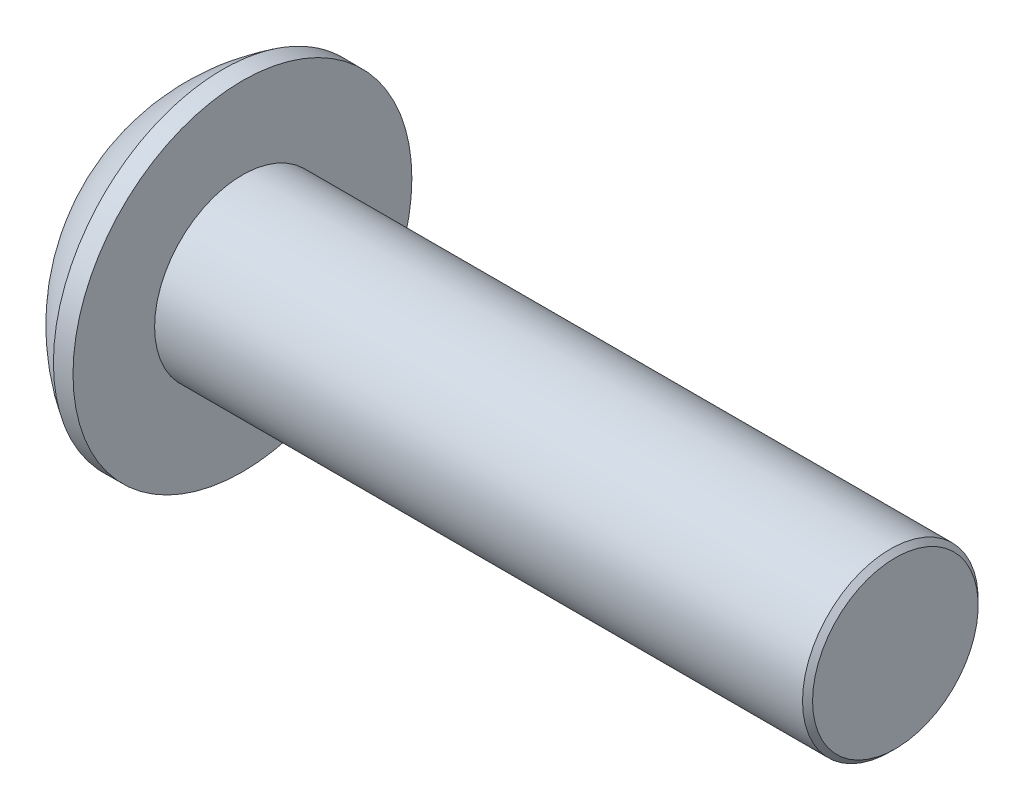
ISO-10303-21;
HEADER;
FILE_DESCRIPTION(('STEP AP214'),'2;1');
FILE_NAME('part.step','',(''),(''),'','','');
FILE_SCHEMA(('AUTOMOTIVE_DESIGN { 1 0 10303 214 1 1 1 1 }'));
ENDSEC;
DATA;
#1=APPLICATION_CONTEXT('core data for automotive mechanical design processes');
#2=APPLICATION_PROTOCOL_DEFINITION('international standard','automotive_design',2000,#1);
#3=PRODUCT_CONTEXT('',#1,'mechanical');
#4=PRODUCT('Part','Part','',(#3));
#5=PRODUCT_RELATED_PRODUCT_CATEGORY('part','',(#4));
#6=PRODUCT_DEFINITION_FORMATION('','',#4);
#7=PRODUCT_DEFINITION_CONTEXT('part definition',#1,'design');
#8=PRODUCT_DEFINITION('design','',#6,#7);
#9=PRODUCT_DEFINITION_SHAPE('','',#8);
#10=(LENGTH_UNIT() NAMED_UNIT(*) SI_UNIT(.MILLI.,.METRE.));
#11=(NAMED_UNIT(*) PLANE_ANGLE_UNIT() SI_UNIT($,.RADIAN.));
#12=(NAMED_UNIT(*) SI_UNIT($,.STERADIAN.) SOLID_ANGLE_UNIT());
#13=UNCERTAINTY_MEASURE_WITH_UNIT(LENGTH_MEASURE(1.E-05),#10,'distance_accuracy_value','');
#14=(GEOMETRIC_REPRESENTATION_CONTEXT(3) GLOBAL_UNCERTAINTY_ASSIGNED_CONTEXT((#13)) GLOBAL_UNIT_ASSIGNED_CONTEXT((#10,
#11,#12)) REPRESENTATION_CONTEXT('',''));
#15=CARTESIAN_POINT('',(0.,0.,0.));
#16=DIRECTION('',(0.,0.,1.));
#17=DIRECTION('',(1.,0.,0.));
#18=AXIS2_PLACEMENT_3D('',#15,#16,#17);
#19=CARTESIAN_POINT('',(1.32080000000034,0.,0.));
#20=DIRECTION('',(-1.,0.,0.));
#21=DIRECTION('',(0.,0.,1.));
#22=AXIS2_PLACEMENT_3D('',#19,#20,#21);
#23=CONICAL_SURFACE('',#22,1.1937999999998,1.04719755119608);
#24=CARTESIAN_POINT('',(2.01004075135902,0.,4.44089209850063E-13));
#25=VERTEX_POINT('',#24);
#26=VERTEX_LOOP('',#25);
#27=FACE_BOUND('',#26,.T.);
#28=CARTESIAN_POINT('',(1.32080000000009,0.,0.));
#29=DIRECTION('',(-1.,0.,0.));
#30=DIRECTION('',(0.,0.,1.));
#31=AXIS2_PLACEMENT_3D('',#28,#29,#30);
#32=CIRCLE('',#31,1.19380000000024);
#33=CARTESIAN_POINT('',(1.32080000000004,-1.03386112703797,0.59690000000006));
#34=VERTEX_POINT('',#33);
#35=CARTESIAN_POINT('',(1.32080000000004,0.,1.19380000000012));
#36=VERTEX_POINT('',#35);
#37=EDGE_CURVE('E18',#34,#36,#32,.T.);
#38=ORIENTED_EDGE('',*,*,#37,.T.);
#39=CARTESIAN_POINT('',(1.32080000000009,0.,0.));
#40=DIRECTION('',(-1.,0.,0.));
#41=DIRECTION('',(0.,0.,1.));
#42=AXIS2_PLACEMENT_3D('',#39,#40,#41);
#43=CIRCLE('',#42,1.19380000000024);
#44=CARTESIAN_POINT('',(1.32080000000004,1.03386112703797,0.596900000000061));
#45=VERTEX_POINT('',#44);
#46=EDGE_CURVE('E146',#36,#45,#43,.T.);
#47=ORIENTED_EDGE('',*,*,#46,.T.);
#48=CARTESIAN_POINT('',(1.32080000000009,0.,0.));
#49=DIRECTION('',(-1.,0.,0.));
#50=DIRECTION('',(0.,0.,1.));
#51=AXIS2_PLACEMENT_3D('',#48,#49,#50);
#52=CIRCLE('',#51,1.19380000000024);
#53=CARTESIAN_POINT('',(1.32080000000004,1.03386112703797,-0.596900000000061));
#54=VERTEX_POINT('',#53);
#55=EDGE_CURVE('E316',#45,#54,#52,.T.);
#56=ORIENTED_EDGE('',*,*,#55,.T.);
#57=CARTESIAN_POINT('',(1.32080000000009,0.,0.));
#58=DIRECTION('',(-1.,0.,0.));
#59=DIRECTION('',(0.,0.,1.));
#60=AXIS2_PLACEMENT_3D('',#57,#58,#59);
#61=CIRCLE('',#60,1.19380000000024);
#62=CARTESIAN_POINT('',(1.32080000000004,1.49457637585666E-12,-1.19380000000012));
#63=VERTEX_POINT('',#62);
#64=EDGE_CURVE('E317',#54,#63,#61,.T.);
#65=ORIENTED_EDGE('',*,*,#64,.T.);
#66=CARTESIAN_POINT('',(1.32080000000009,0.,0.));
#67=DIRECTION('',(-1.,0.,0.));
#68=DIRECTION('',(0.,0.,1.));
#69=AXIS2_PLACEMENT_3D('',#66,#67,#68);
#70=CIRCLE('',#69,1.19380000000024);
#71=CARTESIAN_POINT('',(1.32080000000004,-1.03386112703797,-0.59690000000006));
#72=VERTEX_POINT('',#71);
#73=EDGE_CURVE('E91',#63,#72,#70,.T.);
#74=ORIENTED_EDGE('',*,*,#73,.T.);
#75=CARTESIAN_POINT('',(1.32080000000009,0.,0.));
#76=DIRECTION('',(-1.,0.,0.));
#77=DIRECTION('',(0.,0.,1.));
#78=AXIS2_PLACEMENT_3D('',#75,#76,#77);
#79=CIRCLE('',#78,1.19380000000024);
#80=EDGE_CURVE('E87',#72,#34,#79,.T.);
#81=ORIENTED_EDGE('',*,*,#80,.T.);
#82=EDGE_LOOP('',(#38,#47,#56,#65,#74,#81));
#83=FACE_BOUND('',#82,.T.);
#84=ADVANCED_FACE('F15',(#27,#83),#23,.F.);
#85=CARTESIAN_POINT('',(1.3208,-2.06772225407572,-1.1938));
#86=DIRECTION('',(1.,0.,0.));
#87=DIRECTION('',(0.,0.,-1.));
#88=AXIS2_PLACEMENT_3D('',#85,#86,#87);
#89=PLANE('',#88);
#90=DIRECTION('',(0.,0.5,0.866025403784439));
#91=VECTOR('',#90,1.);
#92=CARTESIAN_POINT('',(1.3208,-1.37848150271715,0.));
#93=LINE('',#92,#91);
#94=CARTESIAN_POINT('',(1.3208,-0.689240751358574,1.1938));
#95=VERTEX_POINT('',#94);
#96=EDGE_CURVE('E99',#95,#34,#93,.F.);
#97=ORIENTED_EDGE('',*,*,#96,.F.);
#98=DIRECTION('',(0.,1.,0.));
#99=VECTOR('',#98,1.);
#100=CARTESIAN_POINT('',(1.3208,-0.689240751358574,1.1938));
#101=LINE('',#100,#99);
#102=EDGE_CURVE('E101',#36,#95,#101,.F.);
#103=ORIENTED_EDGE('',*,*,#102,.F.);
#104=ORIENTED_EDGE('',*,*,#37,.F.);
#105=EDGE_LOOP('',(#97,#103,#104));
#106=FACE_BOUND('',#105,.T.);
#107=ADVANCED_FACE('F97',(#106),#89,.F.);
#108=CARTESIAN_POINT('',(1.3208,-2.06772225407572,-1.1938));
#109=DIRECTION('',(1.,0.,0.));
#110=DIRECTION('',(0.,0.,-1.));
#111=AXIS2_PLACEMENT_3D('',#108,#109,#110);
#112=PLANE('',#111);
#113=DIRECTION('',(0.,-0.5,0.866025403784439));
#114=VECTOR('',#113,1.);
#115=CARTESIAN_POINT('',(1.3208,-0.689240751358574,-1.1938));
#116=LINE('',#115,#114);
#117=CARTESIAN_POINT('',(1.3208,-1.37848150271715,0.));
#118=VERTEX_POINT('',#117);
#119=EDGE_CURVE('E107',#118,#72,#116,.F.);
#120=ORIENTED_EDGE('',*,*,#119,.F.);
#121=DIRECTION('',(0.,0.5,0.866025403784439));
#122=VECTOR('',#121,1.);
#123=CARTESIAN_POINT('',(1.3208,-1.37848150271715,0.));
#124=LINE('',#123,#122);
#125=EDGE_CURVE('E104',#34,#118,#124,.F.);
#126=ORIENTED_EDGE('',*,*,#125,.F.);
#127=ORIENTED_EDGE('',*,*,#80,.F.);
#128=EDGE_LOOP('',(#120,#126,#127));
#129=FACE_BOUND('',#128,.T.);
#130=ADVANCED_FACE('F105',(#129),#112,.F.);
#131=CARTESIAN_POINT('',(1.3208,-2.06772225407572,-1.1938));
#132=DIRECTION('',(1.,0.,0.));
#133=DIRECTION('',(0.,0.,-1.));
#134=AXIS2_PLACEMENT_3D('',#131,#132,#133);
#135=PLANE('',#134);
#136=DIRECTION('',(0.,1.,0.));
#137=VECTOR('',#136,1.);
#138=CARTESIAN_POINT('',(1.3208,0.689240751358577,-1.1938));
#139=LINE('',#138,#137);
#140=CARTESIAN_POINT('',(1.3208,-0.689240751358574,-1.1938));
#141=VERTEX_POINT('',#140);
#142=EDGE_CURVE('E286',#141,#63,#139,.T.);
#143=ORIENTED_EDGE('',*,*,#142,.F.);
#144=DIRECTION('',(0.,-0.5,0.866025403784439));
#145=VECTOR('',#144,1.);
#146=CARTESIAN_POINT('',(1.3208,-0.689240751358574,-1.1938));
#147=LINE('',#146,#145);
#148=EDGE_CURVE('E298',#72,#141,#147,.F.);
#149=ORIENTED_EDGE('',*,*,#148,.F.);
#150=ORIENTED_EDGE('',*,*,#73,.F.);
#151=EDGE_LOOP('',(#143,#149,#150));
#152=FACE_BOUND('',#151,.T.);
#153=ADVANCED_FACE('F189',(#152),#135,.F.);
#154=CARTESIAN_POINT('',(1.3208,-2.06772225407572,-1.1938));
#155=DIRECTION('',(1.,0.,0.));
#156=DIRECTION('',(0.,0.,-1.));
#157=AXIS2_PLACEMENT_3D('',#154,#155,#156);
#158=PLANE('',#157);
#159=DIRECTION('',(0.,-0.5,-0.866025403784439));
#160=VECTOR('',#159,1.);
#161=CARTESIAN_POINT('',(1.3208,1.37848150271715,0.));
#162=LINE('',#161,#160);
#163=CARTESIAN_POINT('',(1.3208,0.689240751358577,-1.1938));
#164=VERTEX_POINT('',#163);
#165=EDGE_CURVE('E272',#164,#54,#162,.F.);
#166=ORIENTED_EDGE('',*,*,#165,.F.);
#167=DIRECTION('',(0.,1.,0.));
#168=VECTOR('',#167,1.);
#169=CARTESIAN_POINT('',(1.3208,0.689240751358577,-1.1938));
#170=LINE('',#169,#168);
#171=EDGE_CURVE('E283',#63,#164,#170,.T.);
#172=ORIENTED_EDGE('',*,*,#171,.F.);
#173=ORIENTED_EDGE('',*,*,#64,.F.);
#174=EDGE_LOOP('',(#166,#172,#173));
#175=FACE_BOUND('',#174,.T.);
#176=ADVANCED_FACE('F185',(#175),#158,.F.);
#177=CARTESIAN_POINT('',(1.3208,-2.06772225407572,-1.1938));
#178=DIRECTION('',(1.,0.,0.));
#179=DIRECTION('',(0.,0.,-1.));
#180=AXIS2_PLACEMENT_3D('',#177,#178,#179);
#181=PLANE('',#180);
#182=DIRECTION('',(0.,0.5,-0.866025403784439));
#183=VECTOR('',#182,1.);
#184=CARTESIAN_POINT('',(1.3208,0.689240751358576,1.1938));
#185=LINE('',#184,#183);
#186=CARTESIAN_POINT('',(1.3208,1.37848150271715,0.));
#187=VERTEX_POINT('',#186);
#188=EDGE_CURVE('E251',#187,#45,#185,.F.);
#189=ORIENTED_EDGE('',*,*,#188,.F.);
#190=DIRECTION('',(0.,-0.5,-0.866025403784439));
#191=VECTOR('',#190,1.);
#192=CARTESIAN_POINT('',(1.3208,1.37848150271715,0.));
#193=LINE('',#192,#191);
#194=EDGE_CURVE('E270',#54,#187,#193,.F.);
#195=ORIENTED_EDGE('',*,*,#194,.F.);
#196=ORIENTED_EDGE('',*,*,#55,.F.);
#197=EDGE_LOOP('',(#189,#195,#196));
#198=FACE_BOUND('',#197,.T.);
#199=ADVANCED_FACE('F181',(#198),#181,.F.);
#200=CARTESIAN_POINT('',(1.3208,-2.06772225407572,-1.1938));
#201=DIRECTION('',(1.,0.,0.));
#202=DIRECTION('',(0.,0.,-1.));
#203=AXIS2_PLACEMENT_3D('',#200,#201,#202);
#204=PLANE('',#203);
#205=DIRECTION('',(0.,1.,0.));
#206=VECTOR('',#205,1.);
#207=CARTESIAN_POINT('',(1.3208,-0.689240751358574,1.1938));
#208=LINE('',#207,#206);
#209=CARTESIAN_POINT('',(1.3208,0.689240751358576,1.1938));
#210=VERTEX_POINT('',#209);
#211=EDGE_CURVE('E116',#210,#36,#208,.F.);
#212=ORIENTED_EDGE('',*,*,#211,.F.);
#213=DIRECTION('',(0.,0.5,-0.866025403784439));
#214=VECTOR('',#213,1.);
#215=CARTESIAN_POINT('',(1.3208,0.689240751358576,1.1938));
#216=LINE('',#215,#214);
#217=EDGE_CURVE('E254',#45,#210,#216,.F.);
#218=ORIENTED_EDGE('',*,*,#217,.F.);
#219=ORIENTED_EDGE('',*,*,#46,.F.);
#220=EDGE_LOOP('',(#212,#218,#219));
#221=FACE_BOUND('',#220,.T.);
#222=ADVANCED_FACE('F177',(#221),#204,.F.);
#223=CARTESIAN_POINT('',(1.3208,-0.689240751358574,1.1938));
#224=DIRECTION('',(0.,0.,-1.));
#225=DIRECTION('',(0.,1.,0.));
#226=AXIS2_PLACEMENT_3D('',#223,#224,#225);
#227=PLANE('',#226);
#228=DIRECTION('',(0.,1.,0.));
#229=VECTOR('',#228,1.);
#230=CARTESIAN_POINT('',(0.,0.,1.1938));
#231=LINE('',#230,#229);
#232=CARTESIAN_POINT('',(0.,0.689240751358577,1.1938));
#233=VERTEX_POINT('',#232);
#234=CARTESIAN_POINT('',(0.,-0.689240751358574,1.1938));
#235=VERTEX_POINT('',#234);
#236=EDGE_CURVE('E248',#233,#235,#231,.F.);
#237=ORIENTED_EDGE('',*,*,#236,.F.);
#238=DIRECTION('',(1.,0.,0.));
#239=VECTOR('',#238,1.);
#240=CARTESIAN_POINT('',(1.3208,0.689240751358576,1.1938));
#241=LINE('',#240,#239);
#242=EDGE_CURVE('E260',#210,#233,#241,.F.);
#243=ORIENTED_EDGE('',*,*,#242,.F.);
#244=ORIENTED_EDGE('',*,*,#211,.T.);
#245=ORIENTED_EDGE('',*,*,#102,.T.);
#246=DIRECTION('',(1.,0.,0.));
#247=VECTOR('',#246,1.);
#248=CARTESIAN_POINT('',(1.3208,-0.689240751358574,1.1938));
#249=LINE('',#248,#247);
#250=EDGE_CURVE('E110',#235,#95,#249,.T.);
#251=ORIENTED_EDGE('',*,*,#250,.F.);
#252=EDGE_LOOP('',(#237,#243,#244,#245,#251));
#253=FACE_BOUND('',#252,.T.);
#254=ADVANCED_FACE('F174',(#253),#227,.T.);
#255=CARTESIAN_POINT('',(1.3208,-1.37848150271715,0.));
#256=DIRECTION('',(0.,0.866025403784439,-0.5));
#257=DIRECTION('',(0.,0.5,0.866025403784439));
#258=AXIS2_PLACEMENT_3D('',#255,#256,#257);
#259=PLANE('',#258);
#260=DIRECTION('',(0.,-0.5,-0.866025403784439));
#261=VECTOR('',#260,1.);
#262=CARTESIAN_POINT('',(0.,-0.689240751358574,1.1938));
#263=LINE('',#262,#261);
#264=CARTESIAN_POINT('',(0.,-1.37848150271715,0.));
#265=VERTEX_POINT('',#264);
#266=EDGE_CURVE('E245',#235,#265,#263,.T.);
#267=ORIENTED_EDGE('',*,*,#266,.F.);
#268=ORIENTED_EDGE('',*,*,#250,.T.);
#269=ORIENTED_EDGE('',*,*,#96,.T.);
#270=ORIENTED_EDGE('',*,*,#125,.T.);
#271=DIRECTION('',(1.,0.,0.));
#272=VECTOR('',#271,1.);
#273=CARTESIAN_POINT('',(1.3208,-1.37848150271715,0.));
#274=LINE('',#273,#272);
#275=EDGE_CURVE('E295',#265,#118,#274,.T.);
#276=ORIENTED_EDGE('',*,*,#275,.F.);
#277=EDGE_LOOP('',(#267,#268,#269,#270,#276));
#278=FACE_BOUND('',#277,.T.);
#279=ADVANCED_FACE('F114',(#278),#259,.T.);
#280=CARTESIAN_POINT('',(1.3208,-0.689240751358574,-1.1938));
#281=DIRECTION('',(0.,0.866025403784439,0.5));
#282=DIRECTION('',(0.,-0.5,0.866025403784439));
#283=AXIS2_PLACEMENT_3D('',#280,#281,#282);
#284=PLANE('',#283);
#285=DIRECTION('',(0.,0.5,-0.866025403784439));
#286=VECTOR('',#285,1.);
#287=CARTESIAN_POINT('',(0.,-1.37848150271715,0.));
#288=LINE('',#287,#286);
#289=CARTESIAN_POINT('',(0.,-0.689240751358574,-1.1938));
#290=VERTEX_POINT('',#289);
#291=EDGE_CURVE('E242',#265,#290,#288,.T.);
#292=ORIENTED_EDGE('',*,*,#291,.F.);
#293=ORIENTED_EDGE('',*,*,#275,.T.);
#294=ORIENTED_EDGE('',*,*,#119,.T.);
#295=ORIENTED_EDGE('',*,*,#148,.T.);
#296=DIRECTION('',(1.,0.,0.));
#297=VECTOR('',#296,1.);
#298=CARTESIAN_POINT('',(1.3208,-0.689240751358574,-1.1938));
#299=LINE('',#298,#297);
#300=EDGE_CURVE('E280',#290,#141,#299,.T.);
#301=ORIENTED_EDGE('',*,*,#300,.F.);
#302=EDGE_LOOP('',(#292,#293,#294,#295,#301));
#303=FACE_BOUND('',#302,.T.);
#304=ADVANCED_FACE('F167',(#303),#284,.T.);
#305=CARTESIAN_POINT('',(1.3208,0.689240751358577,-1.1938));
#306=DIRECTION('',(0.,0.,1.));
#307=DIRECTION('',(1.,0.,0.));
#308=AXIS2_PLACEMENT_3D('',#305,#306,#307);
#309=PLANE('',#308);
#310=DIRECTION('',(0.,1.,0.));
#311=VECTOR('',#310,1.);
#312=CARTESIAN_POINT('',(0.,0.,-1.1938));
#313=LINE('',#312,#311);
#314=CARTESIAN_POINT('',(0.,0.689240751358577,-1.1938));
#315=VERTEX_POINT('',#314);
#316=EDGE_CURVE('E239',#290,#315,#313,.T.);
#317=ORIENTED_EDGE('',*,*,#316,.F.);
#318=ORIENTED_EDGE('',*,*,#300,.T.);
#319=ORIENTED_EDGE('',*,*,#142,.T.);
#320=ORIENTED_EDGE('',*,*,#171,.T.);
#321=DIRECTION('',(1.,0.,0.));
#322=VECTOR('',#321,1.);
#323=CARTESIAN_POINT('',(1.3208,0.689240751358577,-1.1938));
#324=LINE('',#323,#322);
#325=EDGE_CURVE('E255',#315,#164,#324,.T.);
#326=ORIENTED_EDGE('',*,*,#325,.F.);
#327=EDGE_LOOP('',(#317,#318,#319,#320,#326));
#328=FACE_BOUND('',#327,.T.);
#329=ADVANCED_FACE('F164',(#328),#309,.T.);
#330=CARTESIAN_POINT('',(1.3208,1.37848150271715,0.));
#331=DIRECTION('',(0.,-0.866025403784439,0.5));
#332=DIRECTION('',(0.,-0.5,-0.866025403784439));
#333=AXIS2_PLACEMENT_3D('',#330,#331,#332);
#334=PLANE('',#333);
#335=DIRECTION('',(0.,0.5,0.866025403784439));
#336=VECTOR('',#335,1.);
#337=CARTESIAN_POINT('',(0.,0.689240751358577,-1.1938));
#338=LINE('',#337,#336);
#339=CARTESIAN_POINT('',(0.,1.37848150271715,0.));
#340=VERTEX_POINT('',#339);
#341=EDGE_CURVE('E236',#315,#340,#338,.T.);
#342=ORIENTED_EDGE('',*,*,#341,.F.);
#343=ORIENTED_EDGE('',*,*,#325,.T.);
#344=ORIENTED_EDGE('',*,*,#165,.T.);
#345=ORIENTED_EDGE('',*,*,#194,.T.);
#346=DIRECTION('',(1.,0.,0.));
#347=VECTOR('',#346,1.);
#348=CARTESIAN_POINT('',(1.3208,1.37848150271715,0.));
#349=LINE('',#348,#347);
#350=EDGE_CURVE('E33',#340,#187,#349,.T.);
#351=ORIENTED_EDGE('',*,*,#350,.F.);
#352=EDGE_LOOP('',(#342,#343,#344,#345,#351));
#353=FACE_BOUND('',#352,.T.);
#354=ADVANCED_FACE('F160',(#353),#334,.T.);
#355=CARTESIAN_POINT('',(1.3208,0.689240751358576,1.1938));
#356=DIRECTION('',(0.,-0.866025403784439,-0.5));
#357=DIRECTION('',(0.,0.5,-0.866025403784439));
#358=AXIS2_PLACEMENT_3D('',#355,#356,#357);
#359=PLANE('',#358);
#360=DIRECTION('',(0.,-0.5,0.866025403784439));
#361=VECTOR('',#360,1.);
#362=CARTESIAN_POINT('',(0.,1.37848150271715,0.));
#363=LINE('',#362,#361);
#364=EDGE_CURVE('E145',#340,#233,#363,.T.);
#365=ORIENTED_EDGE('',*,*,#364,.F.);
#366=ORIENTED_EDGE('',*,*,#350,.T.);
#367=ORIENTED_EDGE('',*,*,#188,.T.);
#368=ORIENTED_EDGE('',*,*,#217,.T.);
#369=ORIENTED_EDGE('',*,*,#242,.T.);
#370=EDGE_LOOP('',(#365,#366,#367,#368,#369));
#371=FACE_BOUND('',#370,.T.);
#372=ADVANCED_FACE('F156',(#371),#359,.T.);
#373=CARTESIAN_POINT('',(0.,0.,0.));
#374=DIRECTION('',(-1.,0.,0.));
#375=DIRECTION('',(0.,0.,1.));
#376=AXIS2_PLACEMENT_3D('',#373,#374,#375);
#377=PLANE('',#376);
#378=ORIENTED_EDGE('',*,*,#341,.T.);
#379=ORIENTED_EDGE('',*,*,#364,.T.);
#380=ORIENTED_EDGE('',*,*,#236,.T.);
#381=ORIENTED_EDGE('',*,*,#266,.T.);
#382=ORIENTED_EDGE('',*,*,#291,.T.);
#383=ORIENTED_EDGE('',*,*,#316,.T.);
#384=EDGE_LOOP('',(#378,#379,#380,#381,#382,#383));
#385=FACE_BOUND('',#384,.T.);
#386=CARTESIAN_POINT('',(0.,1.647825,0.));
#387=CARTESIAN_POINT('',(1.63319194702151E-13,1.64781976319874,0.092490203977753));
#388=CARTESIAN_POINT('',(1.32890083579297E-13,1.63999511633709,0.18514501432637));
#389=CARTESIAN_POINT('',(0.,1.6167119250047,0.322075808080013));
#390=CARTESIAN_POINT('',(-1.58500729597375E-13,1.60700618770234,0.36743553339636));
#391=CARTESIAN_POINT('',(1.59063479291743E-13,1.58380101865853,0.45722093569514));
#392=CARTESIAN_POINT('',(5.6924253476393E-13,1.5702985083103,0.501645823115263));
#393=CARTESIAN_POINT('',(9.37393023603841E-13,1.52428156574313,0.632817459278967));
#394=CARTESIAN_POINT('',(0.,1.48621992666366,0.717681965518643));
#395=CARTESIAN_POINT('',(0.,1.39637079695658,0.879809706624016));
#396=CARTESIAN_POINT('',(7.82184274151218E-13,1.34458278455109,0.957072652379995));
#397=CARTESIAN_POINT('',(4.86982737501784E-13,1.25777784714521,1.06558770210237));
#398=CARTESIAN_POINT('',(1.33453761487452E-13,1.22729946114794,1.10054993332365));
#399=CARTESIAN_POINT('',(-1.3289162015903E-13,1.16354004969106,1.16775237388221));
#400=CARTESIAN_POINT('',(0.,1.13026175473033,1.19999517515816));
#401=CARTESIAN_POINT('',(0.,1.02649304340867,1.29236218866442));
#402=CARTESIAN_POINT('',(0.,0.952049986714077,1.34814848277712));
#403=CARTESIAN_POINT('',(0.,0.794895196754067,1.44639825105765));
#404=CARTESIAN_POINT('',(0.,0.712183775431296,1.48886222758992));
#405=CARTESIAN_POINT('',(0.,0.540796624265731,1.55930919813143));
#406=CARTESIAN_POINT('',(0.,0.452120958135287,1.58729234680268));
#407=CARTESIAN_POINT('',(0.,0.271332331080319,1.62797191307413));
#408=CARTESIAN_POINT('',(0.,0.179219351801791,1.64066824903626));
#409=CARTESIAN_POINT('',(0.,-0.0058307702784061,1.65041748705408));
#410=CARTESIAN_POINT('',(0.,-0.0987679130800752,1.64747038910978));
#411=CARTESIAN_POINT('',(0.,-0.282830196388822,1.62601274134435));
#412=CARTESIAN_POINT('',(0.,-0.373955346570016,1.60750227463794));
#413=CARTESIAN_POINT('',(0.,-0.551796068178801,1.55545413364523));
#414=CARTESIAN_POINT('',(0.,-0.638511592498163,1.52191629885843));
#415=CARTESIAN_POINT('',(0.,-0.805120175533149,1.44072378052346));
#416=CARTESIAN_POINT('',(0.,-0.885012976819951,1.39306856461393));
#417=CARTESIAN_POINT('',(0.,-0.997912879588355,1.31211658756413));
#418=CARTESIAN_POINT('',(0.,-1.0343949246834,1.28354906167734));
#419=CARTESIAN_POINT('',(0.,-1.10486279842068,1.22341829303709));
#420=CARTESIAN_POINT('',(0.,-1.13884618403291,1.19185218578117));
#421=CARTESIAN_POINT('',(0.,-1.23657300939908,1.09305906467359));
#422=CARTESIAN_POINT('',(0.,-1.29619288399356,1.02166556658612));
#423=CARTESIAN_POINT('',(0.,-1.40258050817755,0.869876423478031));
#424=CARTESIAN_POINT('',(0.,-1.44934874627766,0.789481120793477));
#425=CARTESIAN_POINT('',(0.,-1.50889406070375,0.66387095931334));
#426=CARTESIAN_POINT('',(0.,-1.52698985473586,0.621110806760426));
#427=CARTESIAN_POINT('',(0.,-1.55950093966664,0.53426077686433));
#428=CARTESIAN_POINT('',(-1.05235362596779E-13,-1.57391920916438,0.490172008203167));
#429=CARTESIAN_POINT('',(2.10568324685354E-13,-1.61146177909579,0.356445777718595));
#430=CARTESIAN_POINT('',(1.14396658334039E-12,-1.62897899568074,0.265126085962904));
#431=CARTESIAN_POINT('',(4.347347107204E-13,-1.64174347214908,0.144386595969386));
#432=CARTESIAN_POINT('',(1.21682740895759E-13,-1.64402207668915,0.115560405797873));
#433=CARTESIAN_POINT('',(-1.21249060026839E-13,-1.6470636594012,0.0578281757252688));
#434=CARTESIAN_POINT('',(0.,-1.64782663757318,0.0289221358241775));
#435=CARTESIAN_POINT('',(1.63505268006993E-13,-1.64781976319874,-0.0924902039777536));
#436=CARTESIAN_POINT('',(1.32794566155401E-13,-1.63999511633709,-0.18514501432637));
#437=CARTESIAN_POINT('',(0.,-1.6167119250047,-0.322075808080014));
#438=CARTESIAN_POINT('',(-1.58310187784522E-13,-1.60700618770234,-0.367435533396361));
#439=CARTESIAN_POINT('',(1.58872782530651E-13,-1.58380101865853,-0.45722093569514));
#440=CARTESIAN_POINT('',(5.68527399730162E-13,-1.5702985083103,-0.501645823115263));
#441=CARTESIAN_POINT('',(9.36221934104128E-13,-1.52428156574313,-0.632817459278966));
#442=CARTESIAN_POINT('',(0.,-1.48621992666366,-0.717681965518643));
#443=CARTESIAN_POINT('',(0.,-1.39637079695658,-0.879809706624015));
#444=CARTESIAN_POINT('',(7.809853327574E-13,-1.34458278455109,-0.957072652379992));
#445=CARTESIAN_POINT('',(4.86281382838322E-13,-1.25777784714521,-1.06558770210237));
#446=CARTESIAN_POINT('',(1.33300307899813E-13,-1.22729946114794,-1.10054993332365));
#447=CARTESIAN_POINT('',(-1.32738314523763E-13,-1.16354004969107,-1.16775237388221));
#448=CARTESIAN_POINT('',(0.,-1.13026175473033,-1.19999517515816));
#449=CARTESIAN_POINT('',(0.,-1.02649304340867,-1.29236218866442));
#450=CARTESIAN_POINT('',(0.,-0.952049986714081,-1.34814848277713));
#451=CARTESIAN_POINT('',(0.,-0.794895196754072,-1.44639825105765));
#452=CARTESIAN_POINT('',(0.,-0.7121837754313,-1.48886222758991));
#453=CARTESIAN_POINT('',(0.,-0.540796624265734,-1.55930919813143));
#454=CARTESIAN_POINT('',(0.,-0.452120958135291,-1.58729234680268));
#455=CARTESIAN_POINT('',(0.,-0.271332331080322,-1.62797191307413));
#456=CARTESIAN_POINT('',(0.,-0.179219351801793,-1.64066824903626));
#457=CARTESIAN_POINT('',(0.,0.00583077027840386,-1.65041748705408));
#458=CARTESIAN_POINT('',(0.,0.0987679130800731,-1.64747038910978));
#459=CARTESIAN_POINT('',(0.,0.28283019638882,-1.62601274134436));
#460=CARTESIAN_POINT('',(0.,0.373955346570014,-1.60750227463794));
#461=CARTESIAN_POINT('',(0.,0.551796068178799,-1.55545413364523));
#462=CARTESIAN_POINT('',(0.,0.638511592498161,-1.52191629885844));
#463=CARTESIAN_POINT('',(0.,0.805120175533147,-1.44072378052347));
#464=CARTESIAN_POINT('',(0.,0.885012976819949,-1.39306856461393));
#465=CARTESIAN_POINT('',(0.,0.997912879588353,-1.31211658756413));
#466=CARTESIAN_POINT('',(0.,1.03439492468339,-1.28354906167734));
#467=CARTESIAN_POINT('',(0.,1.10486279842068,-1.22341829303709));
#468=CARTESIAN_POINT('',(0.,1.1388461840329,-1.19185218578117));
#469=CARTESIAN_POINT('',(0.,1.23657300939908,-1.09305906467358));
#470=CARTESIAN_POINT('',(0.,1.29619288399356,-1.02166556658612));
#471=CARTESIAN_POINT('',(0.,1.40258050817755,-0.869876423478032));
#472=CARTESIAN_POINT('',(0.,1.44934874627765,-0.789481120793476));
#473=CARTESIAN_POINT('',(0.,1.50889406070375,-0.66387095931334));
#474=CARTESIAN_POINT('',(0.,1.52698985473586,-0.621110806760427));
#475=CARTESIAN_POINT('',(0.,1.55950093966664,-0.534260776864331));
#476=CARTESIAN_POINT('',(-1.05163336027755E-13,1.57391920916437,-0.490172008203168));
#477=CARTESIAN_POINT('',(2.10424649207135E-13,1.61146177909579,-0.356445777718595));
#478=CARTESIAN_POINT('',(1.1439193518672E-12,1.62897899568074,-0.265126085962905));
#479=CARTESIAN_POINT('',(4.34749480231378E-13,1.64174347214908,-0.144386595969387));
#480=CARTESIAN_POINT('',(1.21707467703441E-13,1.64402207668915,-0.115560405797874));
#481=CARTESIAN_POINT('',(-1.21273786834522E-13,1.6470636594012,-0.0578281757252697));
#482=CARTESIAN_POINT('',(0.,1.64782663757318,-0.0289221358241784));
#483=CARTESIAN_POINT('',(0.,1.647825,0.));
#484=B_SPLINE_CURVE_WITH_KNOTS('',3,(#386,#387,#388,#389,#390,#391,#392,#393,#394,#395,#396,
#397,#398,#399,#400,#401,#402,#403,#404,#405,#406,#407,#408,#409,#410,#411,#412,#413,#414,#415,
#416,#417,#418,#419,#420,#421,#422,#423,#424,#425,#426,#427,#428,#429,#430,#431,#432,#433,#434,
#435,#436,#437,#438,#439,#440,#441,#442,#443,#444,#445,#446,#447,#448,#449,#450,#451,#452,#453,
#454,#455,#456,#457,#458,#459,#460,#461,#462,#463,#464,#465,#466,#467,#468,#469,#470,#471,#472,
#473,#474,#475,#476,#477,#478,#479,#480,#481,#482,#483),.UNSPECIFIED.,.T.,.F.,(4,2,2,2,2,2,2,2,
2,2,2,2,2,2,2,2,2,2,2,2,2,2,2,2,2,2,2,2,2,2,2,2,2,2,2,2,2,2,2,2,2,2,2,2,2,2,2,2,4),(0.,
0.277336029422426,0.416368541537111,0.5555141146256,0.833141970294986,1.11078038089036,
1.24978149120748,1.38864858351854,1.66629367015056,1.94392828594775,2.22155993641642,
2.49919306954937,2.77682620268234,3.05445785315101,3.3320924689482,3.6097375555799,
3.74860464789074,3.88760575820767,4.16524416880332,4.44287202447287,4.5820175975616,
4.72105010967662,4.99838613909882,5.08511046196677,5.17183478483476,5.44917081425719,
5.58820332637187,5.72734889946036,6.00497675512975,6.28261516572512,6.42161627604224,
6.5604833683533,6.83812845498532,7.11576307078251,7.39339472125118,7.67102785438413,
7.9486609875171,8.22629263798578,8.50392725378296,8.78157234041466,8.9204394327255,
9.05944054304243,9.33707895363808,9.61470680930763,9.75385238239637,9.89288489451138,
10.1702209239336,10.2569452468015,10.3436695696695),.UNSPECIFIED.);
#485=CARTESIAN_POINT('',(0.,1.647825,0.));
#486=VERTEX_POINT('',#485);
#487=EDGE_CURVE('E138',#486,#486,#484,.T.);
#488=ORIENTED_EDGE('',*,*,#487,.F.);
#489=EDGE_LOOP('',(#488));
#490=FACE_BOUND('',#489,.T.);
#491=ADVANCED_FACE('F152',(#385,#490),#377,.T.);
#492=CARTESIAN_POINT('',(3.50132362607759,0.,0.));
#493=DIRECTION('',(0.,1.,0.));
#494=DIRECTION('',(1.,0.,0.));
#495=AXIS2_PLACEMENT_3D('',#492,#493,#494);
#496=SPHERICAL_SURFACE('',#495,3.86970210289553);
#497=CARTESIAN_POINT('',(1.4732,0.,0.));
#498=DIRECTION('',(-1.,0.,0.));
#499=DIRECTION('',(0.,0.,1.));
#500=AXIS2_PLACEMENT_3D('',#497,#498,#499);
#501=CIRCLE('',#500,3.29565);
#502=CARTESIAN_POINT('',(1.4732,0.,3.29565));
#503=VERTEX_POINT('',#502);
#504=EDGE_CURVE('E135',#503,#503,#501,.F.);
#505=ORIENTED_EDGE('',*,*,#504,.F.);
#506=EDGE_LOOP('',(#505));
#507=FACE_BOUND('',#506,.T.);
#508=ORIENTED_EDGE('',*,*,#487,.T.);
#509=EDGE_LOOP('',(#508));
#510=FACE_BOUND('',#509,.T.);
#511=ADVANCED_FACE('F148',(#507,#510),#496,.T.);
#512=CARTESIAN_POINT('',(14.5542,0.,0.));
#513=DIRECTION('',(-1.,0.,0.));
#514=DIRECTION('',(0.,0.,1.));
#515=AXIS2_PLACEMENT_3D('',#512,#513,#514);
#516=PLANE('',#515);
#517=CARTESIAN_POINT('',(14.5542000000205,0.,0.));
#518=DIRECTION('',(-1.,0.,0.));
#519=DIRECTION('',(0.,0.,1.));
#520=AXIS2_PLACEMENT_3D('',#517,#518,#519);
#521=CIRCLE('',#520,1.61036000002923);
#522=CARTESIAN_POINT('',(14.5542000000205,0.,1.61036000002923));
#523=VERTEX_POINT('',#522);
#524=EDGE_CURVE('E132',#523,#523,#521,.T.);
#525=ORIENTED_EDGE('',*,*,#524,.F.);
#526=EDGE_LOOP('',(#525));
#527=FACE_BOUND('',#526,.T.);
#528=ADVANCED_FACE('F220',(#527),#516,.F.);
#529=CARTESIAN_POINT('',(0.,0.,0.));
#530=DIRECTION('',(-1.,0.,0.));
#531=DIRECTION('',(0.,0.,1.));
#532=AXIS2_PLACEMENT_3D('',#529,#530,#531);
#533=CYLINDRICAL_SURFACE('',#532,3.29565);
#534=ORIENTED_EDGE('',*,*,#504,.T.);
#535=EDGE_LOOP('',(#534));
#536=FACE_BOUND('',#535,.T.);
#537=CARTESIAN_POINT('',(1.8542,0.,0.));
#538=DIRECTION('',(-1.,0.,0.));
#539=DIRECTION('',(0.,0.,1.));
#540=AXIS2_PLACEMENT_3D('',#537,#538,#539);
#541=CIRCLE('',#540,3.29565);
#542=CARTESIAN_POINT('',(1.8542,0.,3.29565));
#543=VERTEX_POINT('',#542);
#544=EDGE_CURVE('E129',#543,#543,#541,.T.);
#545=ORIENTED_EDGE('',*,*,#544,.T.);
#546=EDGE_LOOP('',(#545));
#547=FACE_BOUND('',#546,.T.);
#548=ADVANCED_FACE('F217',(#536,#547),#533,.T.);
#549=CARTESIAN_POINT('',(14.4564100000935,0.,0.));
#550=DIRECTION('',(-1.,0.,0.));
#551=DIRECTION('',(0.,0.,1.));
#552=AXIS2_PLACEMENT_3D('',#549,#550,#551);
#553=CONICAL_SURFACE('',#552,1.70814999989943,0.785398163106808);
#554=ORIENTED_EDGE('',*,*,#524,.T.);
#555=EDGE_LOOP('',(#554));
#556=FACE_BOUND('',#555,.T.);
#557=CARTESIAN_POINT('',(14.45641,0.,0.));
#558=DIRECTION('',(-1.,0.,0.));
#559=DIRECTION('',(0.,0.,1.));
#560=AXIS2_PLACEMENT_3D('',#557,#558,#559);
#561=CIRCLE('',#560,1.70815);
#562=CARTESIAN_POINT('',(14.45641,0.,1.70815));
#563=VERTEX_POINT('',#562);
#564=EDGE_CURVE('E24',#563,#563,#561,.T.);
#565=ORIENTED_EDGE('',*,*,#564,.F.);
#566=EDGE_LOOP('',(#565));
#567=FACE_BOUND('',#566,.T.);
#568=ADVANCED_FACE('F209',(#556,#567),#553,.T.);
#569=CARTESIAN_POINT('',(1.8542,1.70815,0.));
#570=DIRECTION('',(-1.,0.,0.));
#571=DIRECTION('',(0.,0.,1.));
#572=AXIS2_PLACEMENT_3D('',#569,#570,#571);
#573=PLANE('',#572);
#574=CARTESIAN_POINT('',(1.8542,0.,0.));
#575=DIRECTION('',(-1.,0.,0.));
#576=DIRECTION('',(0.,0.,1.));
#577=AXIS2_PLACEMENT_3D('',#574,#575,#576);
#578=CIRCLE('',#577,1.70815);
#579=CARTESIAN_POINT('',(1.8542,0.,1.70815));
#580=VERTEX_POINT('',#579);
#581=EDGE_CURVE('E10',#580,#580,#578,.F.);
#582=ORIENTED_EDGE('',*,*,#581,.F.);
#583=EDGE_LOOP('',(#582));
#584=FACE_BOUND('',#583,.T.);
#585=ORIENTED_EDGE('',*,*,#544,.F.);
#586=EDGE_LOOP('',(#585));
#587=FACE_BOUND('',#586,.T.);
#588=ADVANCED_FACE('F203',(#584,#587),#573,.F.);
#589=CARTESIAN_POINT('',(0.,0.,0.));
#590=DIRECTION('',(-1.,0.,0.));
#591=DIRECTION('',(0.,0.,1.));
#592=AXIS2_PLACEMENT_3D('',#589,#590,#591);
#593=CYLINDRICAL_SURFACE('',#592,1.70815);
#594=ORIENTED_EDGE('',*,*,#564,.T.);
#595=EDGE_LOOP('',(#594));
#596=FACE_BOUND('',#595,.T.);
#597=ORIENTED_EDGE('',*,*,#581,.T.);
#598=EDGE_LOOP('',(#597));
#599=FACE_BOUND('',#598,.T.);
#600=ADVANCED_FACE('F201',(#596,#599),#593,.T.);
#601=CLOSED_SHELL('',(#84,#107,#130,#153,#176,#199,#222,#254,#279,#304,#329,#354,#372,#491,#511,
#528,#548,#568,#588,#600));
#602=MANIFOLD_SOLID_BREP('B1',#601);
#603=ADVANCED_BREP_SHAPE_REPRESENTATION('',(#18,#602),#14);
#604=SHAPE_DEFINITION_REPRESENTATION(#9,#603);
ENDSEC;
END-ISO-10303-21;
